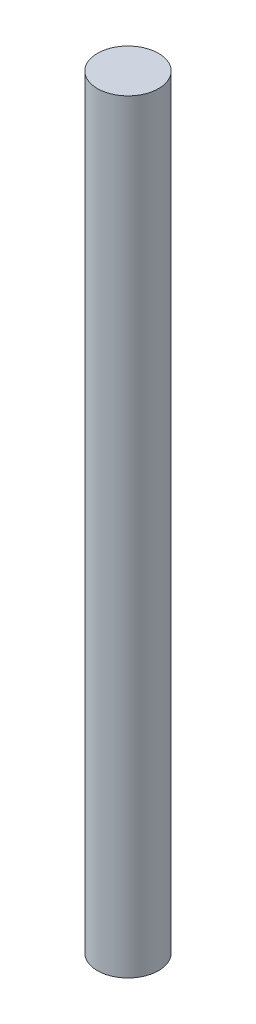
ISO-10303-21;
HEADER;
FILE_DESCRIPTION(('STEP AP214'),'2;1');
FILE_NAME('part.step','',(''),(''),'','','');
FILE_SCHEMA(('AUTOMOTIVE_DESIGN { 1 0 10303 214 1 1 1 1 }'));
ENDSEC;
DATA;
#1=APPLICATION_CONTEXT('core data for automotive mechanical design processes');
#2=APPLICATION_PROTOCOL_DEFINITION('international standard','automotive_design',2000,#1);
#3=PRODUCT_CONTEXT('',#1,'mechanical');
#4=PRODUCT('Part','Part','',(#3));
#5=PRODUCT_RELATED_PRODUCT_CATEGORY('part','',(#4));
#6=PRODUCT_DEFINITION_FORMATION('','',#4);
#7=PRODUCT_DEFINITION_CONTEXT('part definition',#1,'design');
#8=PRODUCT_DEFINITION('design','',#6,#7);
#9=PRODUCT_DEFINITION_SHAPE('','',#8);
#10=(LENGTH_UNIT() NAMED_UNIT(*) SI_UNIT(.MILLI.,.METRE.));
#11=(NAMED_UNIT(*) PLANE_ANGLE_UNIT() SI_UNIT($,.RADIAN.));
#12=(NAMED_UNIT(*) SI_UNIT($,.STERADIAN.) SOLID_ANGLE_UNIT());
#13=UNCERTAINTY_MEASURE_WITH_UNIT(LENGTH_MEASURE(1.E-05),#10,'distance_accuracy_value','');
#14=(GEOMETRIC_REPRESENTATION_CONTEXT(3) GLOBAL_UNCERTAINTY_ASSIGNED_CONTEXT((#13)) GLOBAL_UNIT_ASSIGNED_CONTEXT((#10,
#11,#12)) REPRESENTATION_CONTEXT('',''));
#15=CARTESIAN_POINT('',(0.,0.,0.));
#16=DIRECTION('',(0.,0.,1.));
#17=DIRECTION('',(1.,0.,0.));
#18=AXIS2_PLACEMENT_3D('',#15,#16,#17);
#19=CARTESIAN_POINT('',(0.,100.,0.));
#20=DIRECTION('',(0.,-1.,0.));
#21=DIRECTION('',(0.,0.,-1.));
#22=AXIS2_PLACEMENT_3D('',#19,#20,#21);
#23=CYLINDRICAL_SURFACE('',#22,4.);
#24=CARTESIAN_POINT('',(0.,100.,0.));
#25=DIRECTION('',(0.,1.,0.));
#26=DIRECTION('',(0.,0.,1.));
#27=AXIS2_PLACEMENT_3D('',#24,#25,#26);
#28=CIRCLE('',#27,4.);
#29=CARTESIAN_POINT('',(0.,100.,4.));
#30=VERTEX_POINT('',#29);
#31=EDGE_CURVE('E10',#30,#30,#28,.T.);
#32=ORIENTED_EDGE('',*,*,#31,.F.);
#33=EDGE_LOOP('',(#32));
#34=FACE_BOUND('',#33,.T.);
#35=CARTESIAN_POINT('',(0.,0.,0.));
#36=DIRECTION('',(0.,1.,0.));
#37=DIRECTION('',(0.,0.,1.));
#38=AXIS2_PLACEMENT_3D('',#35,#36,#37);
#39=CIRCLE('',#38,4.);
#40=CARTESIAN_POINT('',(0.,0.,4.));
#41=VERTEX_POINT('',#40);
#42=EDGE_CURVE('E34',#41,#41,#39,.T.);
#43=ORIENTED_EDGE('',*,*,#42,.T.);
#44=EDGE_LOOP('',(#43));
#45=FACE_BOUND('',#44,.T.);
#46=ADVANCED_FACE('F31',(#34,#45),#23,.T.);
#47=CARTESIAN_POINT('',(0.,100.,0.));
#48=DIRECTION('',(0.,1.,0.));
#49=DIRECTION('',(0.,0.,1.));
#50=AXIS2_PLACEMENT_3D('',#47,#48,#49);
#51=PLANE('',#50);
#52=ORIENTED_EDGE('',*,*,#31,.T.);
#53=EDGE_LOOP('',(#52));
#54=FACE_BOUND('',#53,.T.);
#55=ADVANCED_FACE('F46',(#54),#51,.T.);
#56=CARTESIAN_POINT('',(0.,0.,0.));
#57=DIRECTION('',(0.,1.,0.));
#58=DIRECTION('',(0.,0.,1.));
#59=AXIS2_PLACEMENT_3D('',#56,#57,#58);
#60=PLANE('',#59);
#61=ORIENTED_EDGE('',*,*,#42,.F.);
#62=EDGE_LOOP('',(#61));
#63=FACE_BOUND('',#62,.T.);
#64=ADVANCED_FACE('F44',(#63),#60,.F.);
#65=CLOSED_SHELL('',(#46,#55,#64));
#66=MANIFOLD_SOLID_BREP('B2',#65);
#67=ADVANCED_BREP_SHAPE_REPRESENTATION('',(#18,#66),#14);
#68=SHAPE_DEFINITION_REPRESENTATION(#9,#67);
ENDSEC;
END-ISO-10303-21;
